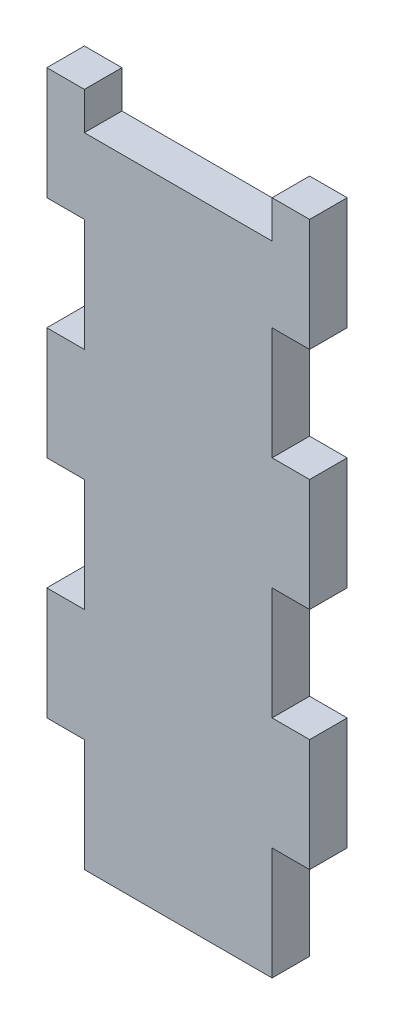
ISO-10303-21;
HEADER;
FILE_DESCRIPTION(('STEP AP214'),'2;1');
FILE_NAME('part.step','',(''),(''),'','','');
FILE_SCHEMA(('AUTOMOTIVE_DESIGN { 1 0 10303 214 1 1 1 1 }'));
ENDSEC;
DATA;
#1=APPLICATION_CONTEXT('core data for automotive mechanical design processes');
#2=APPLICATION_PROTOCOL_DEFINITION('international standard','automotive_design',2000,#1);
#3=PRODUCT_CONTEXT('',#1,'mechanical');
#4=PRODUCT('Part','Part','',(#3));
#5=PRODUCT_RELATED_PRODUCT_CATEGORY('part','',(#4));
#6=PRODUCT_DEFINITION_FORMATION('','',#4);
#7=PRODUCT_DEFINITION_CONTEXT('part definition',#1,'design');
#8=PRODUCT_DEFINITION('design','',#6,#7);
#9=PRODUCT_DEFINITION_SHAPE('','',#8);
#10=(LENGTH_UNIT() NAMED_UNIT(*) SI_UNIT(.MILLI.,.METRE.));
#11=(NAMED_UNIT(*) PLANE_ANGLE_UNIT() SI_UNIT($,.RADIAN.));
#12=(NAMED_UNIT(*) SI_UNIT($,.STERADIAN.) SOLID_ANGLE_UNIT());
#13=UNCERTAINTY_MEASURE_WITH_UNIT(LENGTH_MEASURE(1.E-05),#10,'distance_accuracy_value','');
#14=(GEOMETRIC_REPRESENTATION_CONTEXT(3) GLOBAL_UNCERTAINTY_ASSIGNED_CONTEXT((#13)) GLOBAL_UNIT_ASSIGNED_CONTEXT((#10,
#11,#12)) REPRESENTATION_CONTEXT('',''));
#15=CARTESIAN_POINT('',(0.,0.,0.));
#16=DIRECTION('',(0.,0.,1.));
#17=DIRECTION('',(1.,0.,0.));
#18=AXIS2_PLACEMENT_3D('',#15,#16,#17);
#19=CARTESIAN_POINT('',(18.8215449358851,79.3244842961484,6.));
#20=DIRECTION('',(0.,1.,0.));
#21=DIRECTION('',(0.,0.,1.));
#22=AXIS2_PLACEMENT_3D('',#19,#20,#21);
#23=PLANE('',#22);
#24=DIRECTION('',(1.,0.,0.));
#25=VECTOR('',#24,1.);
#26=CARTESIAN_POINT('',(18.8215449358851,79.3244842961484,0.));
#27=LINE('',#26,#25);
#28=CARTESIAN_POINT('',(18.8215449358851,79.3244842961484,0.));
#29=VERTEX_POINT('',#28);
#30=CARTESIAN_POINT('',(24.8215449358851,79.3244842961484,0.));
#31=VERTEX_POINT('',#30);
#32=EDGE_CURVE('E262',#29,#31,#27,.T.);
#33=ORIENTED_EDGE('',*,*,#32,.F.);
#34=DIRECTION('',(0.,0.,-1.));
#35=VECTOR('',#34,1.);
#36=CARTESIAN_POINT('',(18.8215449358851,79.3244842961484,6.));
#37=LINE('',#36,#35);
#38=CARTESIAN_POINT('',(18.8215449358851,79.3244842961484,6.));
#39=VERTEX_POINT('',#38);
#40=EDGE_CURVE('E11',#39,#29,#37,.T.);
#41=ORIENTED_EDGE('',*,*,#40,.F.);
#42=DIRECTION('',(1.,0.,0.));
#43=VECTOR('',#42,1.);
#44=CARTESIAN_POINT('',(18.8215449358851,79.3244842961484,6.));
#45=LINE('',#44,#43);
#46=CARTESIAN_POINT('',(24.8215449358851,79.3244842961484,6.));
#47=VERTEX_POINT('',#46);
#48=EDGE_CURVE('E364',#39,#47,#45,.T.);
#49=ORIENTED_EDGE('',*,*,#48,.T.);
#50=DIRECTION('',(0.,0.,-1.));
#51=VECTOR('',#50,1.);
#52=CARTESIAN_POINT('',(24.8215449358851,79.3244842961484,6.));
#53=LINE('',#52,#51);
#54=EDGE_CURVE('E42',#47,#31,#53,.T.);
#55=ORIENTED_EDGE('',*,*,#54,.T.);
#56=EDGE_LOOP('',(#33,#41,#49,#55));
#57=FACE_BOUND('',#56,.T.);
#58=ADVANCED_FACE('F39',(#57),#23,.T.);
#59=CARTESIAN_POINT('',(18.8215449358851,79.3244842961484,6.));
#60=DIRECTION('',(1.,0.,0.));
#61=DIRECTION('',(0.,0.,-1.));
#62=AXIS2_PLACEMENT_3D('',#59,#60,#61);
#63=PLANE('',#62);
#64=DIRECTION('',(0.,-1.,0.));
#65=VECTOR('',#64,1.);
#66=CARTESIAN_POINT('',(18.8215449358851,79.3244842961484,0.));
#67=LINE('',#66,#65);
#68=CARTESIAN_POINT('',(18.8215449358851,61.3244842961484,0.));
#69=VERTEX_POINT('',#68);
#70=EDGE_CURVE('E145',#29,#69,#67,.T.);
#71=ORIENTED_EDGE('',*,*,#70,.T.);
#72=DIRECTION('',(0.,0.,-1.));
#73=VECTOR('',#72,1.);
#74=CARTESIAN_POINT('',(18.8215449358851,61.3244842961484,6.));
#75=LINE('',#74,#73);
#76=CARTESIAN_POINT('',(18.8215449358851,61.3244842961484,6.));
#77=VERTEX_POINT('',#76);
#78=EDGE_CURVE('E49',#77,#69,#75,.T.);
#79=ORIENTED_EDGE('',*,*,#78,.F.);
#80=DIRECTION('',(0.,-1.,0.));
#81=VECTOR('',#80,1.);
#82=CARTESIAN_POINT('',(18.8215449358851,79.3244842961484,6.));
#83=LINE('',#82,#81);
#84=EDGE_CURVE('E235',#39,#77,#83,.T.);
#85=ORIENTED_EDGE('',*,*,#84,.F.);
#86=ORIENTED_EDGE('',*,*,#40,.T.);
#87=EDGE_LOOP('',(#71,#79,#85,#86));
#88=FACE_BOUND('',#87,.T.);
#89=ADVANCED_FACE('F637',(#88),#63,.F.);
#90=CARTESIAN_POINT('',(18.8215449358851,61.3244842961484,6.));
#91=DIRECTION('',(0.,1.,0.));
#92=DIRECTION('',(0.,0.,1.));
#93=AXIS2_PLACEMENT_3D('',#90,#91,#92);
#94=PLANE('',#93);
#95=DIRECTION('',(1.,0.,0.));
#96=VECTOR('',#95,1.);
#97=CARTESIAN_POINT('',(18.8215449358851,61.3244842961484,0.));
#98=LINE('',#97,#96);
#99=CARTESIAN_POINT('',(24.8215449358851,61.3244842961484,0.));
#100=VERTEX_POINT('',#99);
#101=EDGE_CURVE('E243',#69,#100,#98,.T.);
#102=ORIENTED_EDGE('',*,*,#101,.T.);
#103=DIRECTION('',(0.,0.,-1.));
#104=VECTOR('',#103,1.);
#105=CARTESIAN_POINT('',(24.8215449358851,61.3244842961484,6.));
#106=LINE('',#105,#104);
#107=CARTESIAN_POINT('',(24.8215449358851,61.3244842961484,6.));
#108=VERTEX_POINT('',#107);
#109=EDGE_CURVE('E240',#108,#100,#106,.T.);
#110=ORIENTED_EDGE('',*,*,#109,.F.);
#111=DIRECTION('',(1.,0.,0.));
#112=VECTOR('',#111,1.);
#113=CARTESIAN_POINT('',(18.8215449358851,61.3244842961484,6.));
#114=LINE('',#113,#112);
#115=EDGE_CURVE('E229',#77,#108,#114,.T.);
#116=ORIENTED_EDGE('',*,*,#115,.F.);
#117=ORIENTED_EDGE('',*,*,#78,.T.);
#118=EDGE_LOOP('',(#102,#110,#116,#117));
#119=FACE_BOUND('',#118,.T.);
#120=ADVANCED_FACE('F241',(#119),#94,.F.);
#121=CARTESIAN_POINT('',(24.8215449358851,61.3244842961484,6.));
#122=DIRECTION('',(1.,0.,0.));
#123=DIRECTION('',(0.,0.,-1.));
#124=AXIS2_PLACEMENT_3D('',#121,#122,#123);
#125=PLANE('',#124);
#126=DIRECTION('',(0.,-1.,0.));
#127=VECTOR('',#126,1.);
#128=CARTESIAN_POINT('',(24.8215449358851,61.3244842961484,0.));
#129=LINE('',#128,#127);
#130=CARTESIAN_POINT('',(24.8215449358851,43.3244842961484,0.));
#131=VERTEX_POINT('',#130);
#132=EDGE_CURVE('E358',#100,#131,#129,.T.);
#133=ORIENTED_EDGE('',*,*,#132,.T.);
#134=DIRECTION('',(0.,0.,-1.));
#135=VECTOR('',#134,1.);
#136=CARTESIAN_POINT('',(24.8215449358851,43.3244842961484,6.));
#137=LINE('',#136,#135);
#138=CARTESIAN_POINT('',(24.8215449358851,43.3244842961484,6.));
#139=VERTEX_POINT('',#138);
#140=EDGE_CURVE('E247',#139,#131,#137,.T.);
#141=ORIENTED_EDGE('',*,*,#140,.F.);
#142=DIRECTION('',(0.,-1.,0.));
#143=VECTOR('',#142,1.);
#144=CARTESIAN_POINT('',(24.8215449358851,61.3244842961484,6.));
#145=LINE('',#144,#143);
#146=EDGE_CURVE('E233',#108,#139,#145,.T.);
#147=ORIENTED_EDGE('',*,*,#146,.F.);
#148=ORIENTED_EDGE('',*,*,#109,.T.);
#149=EDGE_LOOP('',(#133,#141,#147,#148));
#150=FACE_BOUND('',#149,.T.);
#151=ADVANCED_FACE('F249',(#150),#125,.F.);
#152=CARTESIAN_POINT('',(24.8215449358851,43.3244842961484,6.));
#153=DIRECTION('',(0.,-1.,0.));
#154=DIRECTION('',(0.,0.,-1.));
#155=AXIS2_PLACEMENT_3D('',#152,#153,#154);
#156=PLANE('',#155);
#157=DIRECTION('',(-1.,0.,0.));
#158=VECTOR('',#157,1.);
#159=CARTESIAN_POINT('',(24.8215449358851,43.3244842961484,0.));
#160=LINE('',#159,#158);
#161=CARTESIAN_POINT('',(18.8215449358851,43.3244842961484,0.));
#162=VERTEX_POINT('',#161);
#163=EDGE_CURVE('E355',#131,#162,#160,.T.);
#164=ORIENTED_EDGE('',*,*,#163,.T.);
#165=DIRECTION('',(0.,0.,-1.));
#166=VECTOR('',#165,1.);
#167=CARTESIAN_POINT('',(18.8215449358851,43.3244842961484,6.));
#168=LINE('',#167,#166);
#169=CARTESIAN_POINT('',(18.8215449358851,43.3244842961484,6.));
#170=VERTEX_POINT('',#169);
#171=EDGE_CURVE('E370',#170,#162,#168,.T.);
#172=ORIENTED_EDGE('',*,*,#171,.F.);
#173=DIRECTION('',(-1.,0.,0.));
#174=VECTOR('',#173,1.);
#175=CARTESIAN_POINT('',(24.8215449358851,43.3244842961484,6.));
#176=LINE('',#175,#174);
#177=EDGE_CURVE('E253',#139,#170,#176,.T.);
#178=ORIENTED_EDGE('',*,*,#177,.F.);
#179=ORIENTED_EDGE('',*,*,#140,.T.);
#180=EDGE_LOOP('',(#164,#172,#178,#179));
#181=FACE_BOUND('',#180,.T.);
#182=ADVANCED_FACE('F453',(#181),#156,.F.);
#183=CARTESIAN_POINT('',(18.8215449358851,43.3244842961484,6.));
#184=DIRECTION('',(1.,0.,0.));
#185=DIRECTION('',(0.,0.,-1.));
#186=AXIS2_PLACEMENT_3D('',#183,#184,#185);
#187=PLANE('',#186);
#188=DIRECTION('',(0.,-1.,0.));
#189=VECTOR('',#188,1.);
#190=CARTESIAN_POINT('',(18.8215449358851,43.3244842961484,0.));
#191=LINE('',#190,#189);
#192=CARTESIAN_POINT('',(18.8215449358851,25.3244842961484,0.));
#193=VERTEX_POINT('',#192);
#194=EDGE_CURVE('E352',#162,#193,#191,.T.);
#195=ORIENTED_EDGE('',*,*,#194,.T.);
#196=DIRECTION('',(0.,0.,-1.));
#197=VECTOR('',#196,1.);
#198=CARTESIAN_POINT('',(18.8215449358851,25.3244842961484,6.));
#199=LINE('',#198,#197);
#200=CARTESIAN_POINT('',(18.8215449358851,25.3244842961484,6.));
#201=VERTEX_POINT('',#200);
#202=EDGE_CURVE('E374',#201,#193,#199,.T.);
#203=ORIENTED_EDGE('',*,*,#202,.F.);
#204=DIRECTION('',(0.,-1.,0.));
#205=VECTOR('',#204,1.);
#206=CARTESIAN_POINT('',(18.8215449358851,43.3244842961484,6.));
#207=LINE('',#206,#205);
#208=EDGE_CURVE('E256',#170,#201,#207,.T.);
#209=ORIENTED_EDGE('',*,*,#208,.F.);
#210=ORIENTED_EDGE('',*,*,#171,.T.);
#211=EDGE_LOOP('',(#195,#203,#209,#210));
#212=FACE_BOUND('',#211,.T.);
#213=ADVANCED_FACE('F463',(#212),#187,.F.);
#214=CARTESIAN_POINT('',(18.8215449358851,25.3244842961484,6.));
#215=DIRECTION('',(0.,1.,0.));
#216=DIRECTION('',(0.,0.,1.));
#217=AXIS2_PLACEMENT_3D('',#214,#215,#216);
#218=PLANE('',#217);
#219=DIRECTION('',(1.,0.,0.));
#220=VECTOR('',#219,1.);
#221=CARTESIAN_POINT('',(18.8215449358851,25.3244842961484,0.));
#222=LINE('',#221,#220);
#223=CARTESIAN_POINT('',(24.8215449358851,25.3244842961484,0.));
#224=VERTEX_POINT('',#223);
#225=EDGE_CURVE('E348',#193,#224,#222,.T.);
#226=ORIENTED_EDGE('',*,*,#225,.T.);
#227=DIRECTION('',(0.,0.,-1.));
#228=VECTOR('',#227,1.);
#229=CARTESIAN_POINT('',(24.8215449358851,25.3244842961484,6.));
#230=LINE('',#229,#228);
#231=CARTESIAN_POINT('',(24.8215449358851,25.3244842961484,6.));
#232=VERTEX_POINT('',#231);
#233=EDGE_CURVE('E378',#232,#224,#230,.T.);
#234=ORIENTED_EDGE('',*,*,#233,.F.);
#235=DIRECTION('',(1.,0.,0.));
#236=VECTOR('',#235,1.);
#237=CARTESIAN_POINT('',(18.8215449358851,25.3244842961484,6.));
#238=LINE('',#237,#236);
#239=EDGE_CURVE('E459',#201,#232,#238,.T.);
#240=ORIENTED_EDGE('',*,*,#239,.F.);
#241=ORIENTED_EDGE('',*,*,#202,.T.);
#242=EDGE_LOOP('',(#226,#234,#240,#241));
#243=FACE_BOUND('',#242,.T.);
#244=ADVANCED_FACE('F466',(#243),#218,.F.);
#245=CARTESIAN_POINT('',(24.8215449358842,15.3244842961493,6.));
#246=DIRECTION('',(-1.,0.,0.));
#247=DIRECTION('',(0.,-1.,0.));
#248=AXIS2_PLACEMENT_3D('',#245,#246,#247);
#249=PLANE('',#248);
#250=DIRECTION('',(0.,1.,0.));
#251=VECTOR('',#250,1.);
#252=CARTESIAN_POINT('',(24.8215449358842,15.3244842961493,0.));
#253=LINE('',#252,#251);
#254=CARTESIAN_POINT('',(24.8215449358837,7.32448429615111,0.));
#255=VERTEX_POINT('',#254);
#256=EDGE_CURVE('E344',#255,#224,#253,.T.);
#257=ORIENTED_EDGE('',*,*,#256,.F.);
#258=DIRECTION('',(0.,0.,-1.));
#259=VECTOR('',#258,1.);
#260=CARTESIAN_POINT('',(24.8215449358837,7.32448429615111,6.));
#261=LINE('',#260,#259);
#262=CARTESIAN_POINT('',(24.8215449358837,7.32448429615111,6.));
#263=VERTEX_POINT('',#262);
#264=EDGE_CURVE('E381',#263,#255,#261,.T.);
#265=ORIENTED_EDGE('',*,*,#264,.F.);
#266=DIRECTION('',(0.,-1.,0.));
#267=VECTOR('',#266,1.);
#268=CARTESIAN_POINT('',(24.8215449358842,15.3244842961493,6.));
#269=LINE('',#268,#267);
#270=EDGE_CURVE('E468',#232,#263,#269,.T.);
#271=ORIENTED_EDGE('',*,*,#270,.F.);
#272=ORIENTED_EDGE('',*,*,#233,.T.);
#273=EDGE_LOOP('',(#257,#265,#271,#272));
#274=FACE_BOUND('',#273,.T.);
#275=ADVANCED_FACE('F626',(#274),#249,.T.);
#276=CARTESIAN_POINT('',(54.8215449358851,7.32448429614838,6.));
#277=DIRECTION('',(0.,-1.,0.));
#278=DIRECTION('',(1.,0.,0.));
#279=AXIS2_PLACEMENT_3D('',#276,#277,#278);
#280=PLANE('',#279);
#281=DIRECTION('',(-1.,0.,0.));
#282=VECTOR('',#281,1.);
#283=CARTESIAN_POINT('',(54.8215449358851,7.32448429614838,0.));
#284=LINE('',#283,#282);
#285=CARTESIAN_POINT('',(54.8215449358851,7.32448429614838,0.));
#286=VERTEX_POINT('',#285);
#287=EDGE_CURVE('E340',#286,#255,#284,.T.);
#288=ORIENTED_EDGE('',*,*,#287,.F.);
#289=DIRECTION('',(0.,0.,-1.));
#290=VECTOR('',#289,1.);
#291=CARTESIAN_POINT('',(54.8215449358851,7.32448429614838,6.));
#292=LINE('',#291,#290);
#293=CARTESIAN_POINT('',(54.8215449358851,7.32448429614838,6.));
#294=VERTEX_POINT('',#293);
#295=EDGE_CURVE('E385',#294,#286,#292,.T.);
#296=ORIENTED_EDGE('',*,*,#295,.F.);
#297=DIRECTION('',(-1.,0.,0.));
#298=VECTOR('',#297,1.);
#299=CARTESIAN_POINT('',(54.8215449358851,7.32448429614838,6.));
#300=LINE('',#299,#298);
#301=EDGE_CURVE('E471',#294,#263,#300,.T.);
#302=ORIENTED_EDGE('',*,*,#301,.T.);
#303=ORIENTED_EDGE('',*,*,#264,.T.);
#304=EDGE_LOOP('',(#288,#296,#302,#303));
#305=FACE_BOUND('',#304,.T.);
#306=ADVANCED_FACE('F623',(#305),#280,.T.);
#307=CARTESIAN_POINT('',(54.8215449358851,25.3244842961484,6.));
#308=DIRECTION('',(1.,0.,0.));
#309=DIRECTION('',(0.,0.,-1.));
#310=AXIS2_PLACEMENT_3D('',#307,#308,#309);
#311=PLANE('',#310);
#312=DIRECTION('',(0.,-1.,0.));
#313=VECTOR('',#312,1.);
#314=CARTESIAN_POINT('',(54.8215449358851,25.3244842961484,0.));
#315=LINE('',#314,#313);
#316=CARTESIAN_POINT('',(54.8215449358851,25.3244842961484,0.));
#317=VERTEX_POINT('',#316);
#318=EDGE_CURVE('E336',#317,#286,#315,.T.);
#319=ORIENTED_EDGE('',*,*,#318,.F.);
#320=DIRECTION('',(0.,0.,-1.));
#321=VECTOR('',#320,1.);
#322=CARTESIAN_POINT('',(54.8215449358851,25.3244842961484,6.));
#323=LINE('',#322,#321);
#324=CARTESIAN_POINT('',(54.8215449358851,25.3244842961484,6.));
#325=VERTEX_POINT('',#324);
#326=EDGE_CURVE('E388',#325,#317,#323,.T.);
#327=ORIENTED_EDGE('',*,*,#326,.F.);
#328=DIRECTION('',(0.,-1.,0.));
#329=VECTOR('',#328,1.);
#330=CARTESIAN_POINT('',(54.8215449358851,25.3244842961484,6.));
#331=LINE('',#330,#329);
#332=EDGE_CURVE('E477',#325,#294,#331,.T.);
#333=ORIENTED_EDGE('',*,*,#332,.T.);
#334=ORIENTED_EDGE('',*,*,#295,.T.);
#335=EDGE_LOOP('',(#319,#327,#333,#334));
#336=FACE_BOUND('',#335,.T.);
#337=ADVANCED_FACE('F619',(#336),#311,.T.);
#338=CARTESIAN_POINT('',(60.8215449358851,25.3244842961484,6.));
#339=DIRECTION('',(0.,-1.,0.));
#340=DIRECTION('',(0.,0.,-1.));
#341=AXIS2_PLACEMENT_3D('',#338,#339,#340);
#342=PLANE('',#341);
#343=DIRECTION('',(-1.,0.,0.));
#344=VECTOR('',#343,1.);
#345=CARTESIAN_POINT('',(60.8215449358851,25.3244842961484,0.));
#346=LINE('',#345,#344);
#347=CARTESIAN_POINT('',(60.8215449358851,25.3244842961484,0.));
#348=VERTEX_POINT('',#347);
#349=EDGE_CURVE('E332',#348,#317,#346,.T.);
#350=ORIENTED_EDGE('',*,*,#349,.F.);
#351=DIRECTION('',(0.,0.,-1.));
#352=VECTOR('',#351,1.);
#353=CARTESIAN_POINT('',(60.8215449358851,25.3244842961484,6.));
#354=LINE('',#353,#352);
#355=CARTESIAN_POINT('',(60.8215449358851,25.3244842961484,6.));
#356=VERTEX_POINT('',#355);
#357=EDGE_CURVE('E391',#356,#348,#354,.T.);
#358=ORIENTED_EDGE('',*,*,#357,.F.);
#359=DIRECTION('',(-1.,0.,0.));
#360=VECTOR('',#359,1.);
#361=CARTESIAN_POINT('',(60.8215449358851,25.3244842961484,6.));
#362=LINE('',#361,#360);
#363=EDGE_CURVE('E481',#356,#325,#362,.T.);
#364=ORIENTED_EDGE('',*,*,#363,.T.);
#365=ORIENTED_EDGE('',*,*,#326,.T.);
#366=EDGE_LOOP('',(#350,#358,#364,#365));
#367=FACE_BOUND('',#366,.T.);
#368=ADVANCED_FACE('F615',(#367),#342,.T.);
#369=CARTESIAN_POINT('',(60.8215449358851,43.3244842961484,6.));
#370=DIRECTION('',(1.,0.,0.));
#371=DIRECTION('',(0.,0.,-1.));
#372=AXIS2_PLACEMENT_3D('',#369,#370,#371);
#373=PLANE('',#372);
#374=DIRECTION('',(0.,-1.,0.));
#375=VECTOR('',#374,1.);
#376=CARTESIAN_POINT('',(60.8215449358851,43.3244842961484,0.));
#377=LINE('',#376,#375);
#378=CARTESIAN_POINT('',(60.8215449358851,43.3244842961484,0.));
#379=VERTEX_POINT('',#378);
#380=EDGE_CURVE('E328',#379,#348,#377,.T.);
#381=ORIENTED_EDGE('',*,*,#380,.F.);
#382=DIRECTION('',(0.,0.,-1.));
#383=VECTOR('',#382,1.);
#384=CARTESIAN_POINT('',(60.8215449358851,43.3244842961484,6.));
#385=LINE('',#384,#383);
#386=CARTESIAN_POINT('',(60.8215449358851,43.3244842961484,6.));
#387=VERTEX_POINT('',#386);
#388=EDGE_CURVE('E394',#387,#379,#385,.T.);
#389=ORIENTED_EDGE('',*,*,#388,.F.);
#390=DIRECTION('',(0.,-1.,0.));
#391=VECTOR('',#390,1.);
#392=CARTESIAN_POINT('',(60.8215449358851,43.3244842961484,6.));
#393=LINE('',#392,#391);
#394=EDGE_CURVE('E485',#387,#356,#393,.T.);
#395=ORIENTED_EDGE('',*,*,#394,.T.);
#396=ORIENTED_EDGE('',*,*,#357,.T.);
#397=EDGE_LOOP('',(#381,#389,#395,#396));
#398=FACE_BOUND('',#397,.T.);
#399=ADVANCED_FACE('F611',(#398),#373,.T.);
#400=CARTESIAN_POINT('',(54.8215449358851,43.3244842961484,6.));
#401=DIRECTION('',(0.,1.,0.));
#402=DIRECTION('',(0.,0.,1.));
#403=AXIS2_PLACEMENT_3D('',#400,#401,#402);
#404=PLANE('',#403);
#405=DIRECTION('',(1.,0.,0.));
#406=VECTOR('',#405,1.);
#407=CARTESIAN_POINT('',(54.8215449358851,43.3244842961484,0.));
#408=LINE('',#407,#406);
#409=CARTESIAN_POINT('',(54.8215449358851,43.3244842961484,0.));
#410=VERTEX_POINT('',#409);
#411=EDGE_CURVE('E324',#410,#379,#408,.T.);
#412=ORIENTED_EDGE('',*,*,#411,.F.);
#413=DIRECTION('',(0.,0.,-1.));
#414=VECTOR('',#413,1.);
#415=CARTESIAN_POINT('',(54.8215449358851,43.3244842961484,6.));
#416=LINE('',#415,#414);
#417=CARTESIAN_POINT('',(54.8215449358851,43.3244842961484,6.));
#418=VERTEX_POINT('',#417);
#419=EDGE_CURVE('E397',#418,#410,#416,.T.);
#420=ORIENTED_EDGE('',*,*,#419,.F.);
#421=DIRECTION('',(1.,0.,0.));
#422=VECTOR('',#421,1.);
#423=CARTESIAN_POINT('',(54.8215449358851,43.3244842961484,6.));
#424=LINE('',#423,#422);
#425=EDGE_CURVE('E489',#418,#387,#424,.T.);
#426=ORIENTED_EDGE('',*,*,#425,.T.);
#427=ORIENTED_EDGE('',*,*,#388,.T.);
#428=EDGE_LOOP('',(#412,#420,#426,#427));
#429=FACE_BOUND('',#428,.T.);
#430=ADVANCED_FACE('F607',(#429),#404,.T.);
#431=CARTESIAN_POINT('',(54.8215449358851,61.3244842961484,6.));
#432=DIRECTION('',(1.,0.,0.));
#433=DIRECTION('',(0.,0.,-1.));
#434=AXIS2_PLACEMENT_3D('',#431,#432,#433);
#435=PLANE('',#434);
#436=DIRECTION('',(0.,-1.,0.));
#437=VECTOR('',#436,1.);
#438=CARTESIAN_POINT('',(54.8215449358851,61.3244842961484,0.));
#439=LINE('',#438,#437);
#440=CARTESIAN_POINT('',(54.8215449358851,61.3244842961484,0.));
#441=VERTEX_POINT('',#440);
#442=EDGE_CURVE('E320',#441,#410,#439,.T.);
#443=ORIENTED_EDGE('',*,*,#442,.F.);
#444=DIRECTION('',(0.,0.,-1.));
#445=VECTOR('',#444,1.);
#446=CARTESIAN_POINT('',(54.8215449358851,61.3244842961484,6.));
#447=LINE('',#446,#445);
#448=CARTESIAN_POINT('',(54.8215449358851,61.3244842961484,6.));
#449=VERTEX_POINT('',#448);
#450=EDGE_CURVE('E400',#449,#441,#447,.T.);
#451=ORIENTED_EDGE('',*,*,#450,.F.);
#452=DIRECTION('',(0.,-1.,0.));
#453=VECTOR('',#452,1.);
#454=CARTESIAN_POINT('',(54.8215449358851,61.3244842961484,6.));
#455=LINE('',#454,#453);
#456=EDGE_CURVE('E493',#449,#418,#455,.T.);
#457=ORIENTED_EDGE('',*,*,#456,.T.);
#458=ORIENTED_EDGE('',*,*,#419,.T.);
#459=EDGE_LOOP('',(#443,#451,#457,#458));
#460=FACE_BOUND('',#459,.T.);
#461=ADVANCED_FACE('F603',(#460),#435,.T.);
#462=CARTESIAN_POINT('',(60.8215449358851,61.3244842961484,6.));
#463=DIRECTION('',(0.,-1.,0.));
#464=DIRECTION('',(0.,0.,-1.));
#465=AXIS2_PLACEMENT_3D('',#462,#463,#464);
#466=PLANE('',#465);
#467=DIRECTION('',(-1.,0.,0.));
#468=VECTOR('',#467,1.);
#469=CARTESIAN_POINT('',(60.8215449358851,61.3244842961484,0.));
#470=LINE('',#469,#468);
#471=CARTESIAN_POINT('',(60.8215449358851,61.3244842961484,0.));
#472=VERTEX_POINT('',#471);
#473=EDGE_CURVE('E316',#472,#441,#470,.T.);
#474=ORIENTED_EDGE('',*,*,#473,.F.);
#475=DIRECTION('',(0.,0.,-1.));
#476=VECTOR('',#475,1.);
#477=CARTESIAN_POINT('',(60.8215449358851,61.3244842961484,6.));
#478=LINE('',#477,#476);
#479=CARTESIAN_POINT('',(60.8215449358851,61.3244842961484,6.));
#480=VERTEX_POINT('',#479);
#481=EDGE_CURVE('E403',#480,#472,#478,.T.);
#482=ORIENTED_EDGE('',*,*,#481,.F.);
#483=DIRECTION('',(-1.,0.,0.));
#484=VECTOR('',#483,1.);
#485=CARTESIAN_POINT('',(60.8215449358851,61.3244842961484,6.));
#486=LINE('',#485,#484);
#487=EDGE_CURVE('E497',#480,#449,#486,.T.);
#488=ORIENTED_EDGE('',*,*,#487,.T.);
#489=ORIENTED_EDGE('',*,*,#450,.T.);
#490=EDGE_LOOP('',(#474,#482,#488,#489));
#491=FACE_BOUND('',#490,.T.);
#492=ADVANCED_FACE('F599',(#491),#466,.T.);
#493=CARTESIAN_POINT('',(60.8215449358851,79.3244842961484,6.));
#494=DIRECTION('',(1.,0.,0.));
#495=DIRECTION('',(0.,0.,-1.));
#496=AXIS2_PLACEMENT_3D('',#493,#494,#495);
#497=PLANE('',#496);
#498=DIRECTION('',(0.,-1.,0.));
#499=VECTOR('',#498,1.);
#500=CARTESIAN_POINT('',(60.8215449358851,79.3244842961484,0.));
#501=LINE('',#500,#499);
#502=CARTESIAN_POINT('',(60.8215449358851,79.3244842961484,0.));
#503=VERTEX_POINT('',#502);
#504=EDGE_CURVE('E312',#503,#472,#501,.T.);
#505=ORIENTED_EDGE('',*,*,#504,.F.);
#506=DIRECTION('',(0.,0.,-1.));
#507=VECTOR('',#506,1.);
#508=CARTESIAN_POINT('',(60.8215449358851,79.3244842961484,6.));
#509=LINE('',#508,#507);
#510=CARTESIAN_POINT('',(60.8215449358851,79.3244842961484,6.));
#511=VERTEX_POINT('',#510);
#512=EDGE_CURVE('E406',#511,#503,#509,.T.);
#513=ORIENTED_EDGE('',*,*,#512,.F.);
#514=DIRECTION('',(0.,-1.,0.));
#515=VECTOR('',#514,1.);
#516=CARTESIAN_POINT('',(60.8215449358851,79.3244842961484,6.));
#517=LINE('',#516,#515);
#518=EDGE_CURVE('E501',#511,#480,#517,.T.);
#519=ORIENTED_EDGE('',*,*,#518,.T.);
#520=ORIENTED_EDGE('',*,*,#481,.T.);
#521=EDGE_LOOP('',(#505,#513,#519,#520));
#522=FACE_BOUND('',#521,.T.);
#523=ADVANCED_FACE('F593',(#522),#497,.T.);
#524=CARTESIAN_POINT('',(60.8215449358851,79.3244842961484,6.));
#525=DIRECTION('',(0.,-1.,0.));
#526=DIRECTION('',(0.,0.,-1.));
#527=AXIS2_PLACEMENT_3D('',#524,#525,#526);
#528=PLANE('',#527);
#529=DIRECTION('',(-1.,0.,0.));
#530=VECTOR('',#529,1.);
#531=CARTESIAN_POINT('',(60.8215449358851,79.3244842961484,0.));
#532=LINE('',#531,#530);
#533=CARTESIAN_POINT('',(54.8215449358851,79.3244842961484,0.));
#534=VERTEX_POINT('',#533);
#535=EDGE_CURVE('E308',#503,#534,#532,.T.);
#536=ORIENTED_EDGE('',*,*,#535,.T.);
#537=DIRECTION('',(0.,0.,-1.));
#538=VECTOR('',#537,1.);
#539=CARTESIAN_POINT('',(54.8215449358851,79.3244842961484,6.));
#540=LINE('',#539,#538);
#541=CARTESIAN_POINT('',(54.8215449358851,79.3244842961484,6.));
#542=VERTEX_POINT('',#541);
#543=EDGE_CURVE('E409',#542,#534,#540,.T.);
#544=ORIENTED_EDGE('',*,*,#543,.F.);
#545=DIRECTION('',(-1.,0.,0.));
#546=VECTOR('',#545,1.);
#547=CARTESIAN_POINT('',(60.8215449358851,79.3244842961484,6.));
#548=LINE('',#547,#546);
#549=EDGE_CURVE('E505',#511,#542,#548,.T.);
#550=ORIENTED_EDGE('',*,*,#549,.F.);
#551=ORIENTED_EDGE('',*,*,#512,.T.);
#552=EDGE_LOOP('',(#536,#544,#550,#551));
#553=FACE_BOUND('',#552,.T.);
#554=ADVANCED_FACE('F627',(#553),#528,.F.);
#555=CARTESIAN_POINT('',(54.8215449358851,97.3244842961484,6.));
#556=DIRECTION('',(1.,0.,0.));
#557=DIRECTION('',(0.,0.,-1.));
#558=AXIS2_PLACEMENT_3D('',#555,#556,#557);
#559=PLANE('',#558);
#560=DIRECTION('',(0.,-1.,0.));
#561=VECTOR('',#560,1.);
#562=CARTESIAN_POINT('',(54.8215449358851,97.3244842961484,0.));
#563=LINE('',#562,#561);
#564=CARTESIAN_POINT('',(54.8215449358851,97.3244842961484,0.));
#565=VERTEX_POINT('',#564);
#566=EDGE_CURVE('E304',#565,#534,#563,.T.);
#567=ORIENTED_EDGE('',*,*,#566,.F.);
#568=DIRECTION('',(0.,0.,-1.));
#569=VECTOR('',#568,1.);
#570=CARTESIAN_POINT('',(54.8215449358851,97.3244842961484,6.));
#571=LINE('',#570,#569);
#572=CARTESIAN_POINT('',(54.8215449358851,97.3244842961484,6.));
#573=VERTEX_POINT('',#572);
#574=EDGE_CURVE('E412',#573,#565,#571,.T.);
#575=ORIENTED_EDGE('',*,*,#574,.F.);
#576=DIRECTION('',(0.,-1.,0.));
#577=VECTOR('',#576,1.);
#578=CARTESIAN_POINT('',(54.8215449358851,97.3244842961484,6.));
#579=LINE('',#578,#577);
#580=EDGE_CURVE('E508',#573,#542,#579,.T.);
#581=ORIENTED_EDGE('',*,*,#580,.T.);
#582=ORIENTED_EDGE('',*,*,#543,.T.);
#583=EDGE_LOOP('',(#567,#575,#581,#582));
#584=FACE_BOUND('',#583,.T.);
#585=ADVANCED_FACE('F587',(#584),#559,.T.);
#586=CARTESIAN_POINT('',(60.8215449358851,97.3244842961484,6.));
#587=DIRECTION('',(0.,-1.,0.));
#588=DIRECTION('',(0.,0.,-1.));
#589=AXIS2_PLACEMENT_3D('',#586,#587,#588);
#590=PLANE('',#589);
#591=DIRECTION('',(-1.,0.,0.));
#592=VECTOR('',#591,1.);
#593=CARTESIAN_POINT('',(60.8215449358851,97.3244842961484,0.));
#594=LINE('',#593,#592);
#595=CARTESIAN_POINT('',(60.8215449358851,97.3244842961484,0.));
#596=VERTEX_POINT('',#595);
#597=EDGE_CURVE('E300',#596,#565,#594,.T.);
#598=ORIENTED_EDGE('',*,*,#597,.F.);
#599=DIRECTION('',(0.,0.,-1.));
#600=VECTOR('',#599,1.);
#601=CARTESIAN_POINT('',(60.8215449358851,97.3244842961484,6.));
#602=LINE('',#601,#600);
#603=CARTESIAN_POINT('',(60.8215449358851,97.3244842961484,6.));
#604=VERTEX_POINT('',#603);
#605=EDGE_CURVE('E415',#604,#596,#602,.T.);
#606=ORIENTED_EDGE('',*,*,#605,.F.);
#607=DIRECTION('',(-1.,0.,0.));
#608=VECTOR('',#607,1.);
#609=CARTESIAN_POINT('',(60.8215449358851,97.3244842961484,6.));
#610=LINE('',#609,#608);
#611=EDGE_CURVE('E512',#604,#573,#610,.T.);
#612=ORIENTED_EDGE('',*,*,#611,.T.);
#613=ORIENTED_EDGE('',*,*,#574,.T.);
#614=EDGE_LOOP('',(#598,#606,#612,#613));
#615=FACE_BOUND('',#614,.T.);
#616=ADVANCED_FACE('F583',(#615),#590,.T.);
#617=CARTESIAN_POINT('',(60.8215449358851,115.324484296148,6.));
#618=DIRECTION('',(1.,0.,0.));
#619=DIRECTION('',(0.,0.,-1.));
#620=AXIS2_PLACEMENT_3D('',#617,#618,#619);
#621=PLANE('',#620);
#622=DIRECTION('',(0.,-1.,0.));
#623=VECTOR('',#622,1.);
#624=CARTESIAN_POINT('',(60.8215449358851,115.324484296148,0.));
#625=LINE('',#624,#623);
#626=CARTESIAN_POINT('',(60.8215449358851,115.324484296148,0.));
#627=VERTEX_POINT('',#626);
#628=EDGE_CURVE('E296',#627,#596,#625,.T.);
#629=ORIENTED_EDGE('',*,*,#628,.F.);
#630=DIRECTION('',(0.,0.,-1.));
#631=VECTOR('',#630,1.);
#632=CARTESIAN_POINT('',(60.8215449358851,115.324484296148,6.));
#633=LINE('',#632,#631);
#634=CARTESIAN_POINT('',(60.8215449358851,115.324484296148,6.));
#635=VERTEX_POINT('',#634);
#636=EDGE_CURVE('E418',#635,#627,#633,.T.);
#637=ORIENTED_EDGE('',*,*,#636,.F.);
#638=DIRECTION('',(0.,-1.,0.));
#639=VECTOR('',#638,1.);
#640=CARTESIAN_POINT('',(60.8215449358851,115.324484296148,6.));
#641=LINE('',#640,#639);
#642=EDGE_CURVE('E516',#635,#604,#641,.T.);
#643=ORIENTED_EDGE('',*,*,#642,.T.);
#644=ORIENTED_EDGE('',*,*,#605,.T.);
#645=EDGE_LOOP('',(#629,#637,#643,#644));
#646=FACE_BOUND('',#645,.T.);
#647=ADVANCED_FACE('F579',(#646),#621,.T.);
#648=CARTESIAN_POINT('',(54.8215449358842,115.324484296148,6.));
#649=DIRECTION('',(0.,1.,0.));
#650=DIRECTION('',(0.,0.,1.));
#651=AXIS2_PLACEMENT_3D('',#648,#649,#650);
#652=PLANE('',#651);
#653=DIRECTION('',(1.,0.,0.));
#654=VECTOR('',#653,1.);
#655=CARTESIAN_POINT('',(54.8215449358842,115.324484296148,0.));
#656=LINE('',#655,#654);
#657=CARTESIAN_POINT('',(54.8215449358842,115.324484296148,0.));
#658=VERTEX_POINT('',#657);
#659=EDGE_CURVE('E292',#658,#627,#656,.T.);
#660=ORIENTED_EDGE('',*,*,#659,.F.);
#661=DIRECTION('',(0.,0.,-1.));
#662=VECTOR('',#661,1.);
#663=CARTESIAN_POINT('',(54.8215449358842,115.324484296148,6.));
#664=LINE('',#663,#662);
#665=CARTESIAN_POINT('',(54.8215449358842,115.324484296148,6.));
#666=VERTEX_POINT('',#665);
#667=EDGE_CURVE('E421',#666,#658,#664,.T.);
#668=ORIENTED_EDGE('',*,*,#667,.F.);
#669=DIRECTION('',(1.,0.,0.));
#670=VECTOR('',#669,1.);
#671=CARTESIAN_POINT('',(54.8215449358842,115.324484296148,6.));
#672=LINE('',#671,#670);
#673=EDGE_CURVE('E520',#666,#635,#672,.T.);
#674=ORIENTED_EDGE('',*,*,#673,.T.);
#675=ORIENTED_EDGE('',*,*,#636,.T.);
#676=EDGE_LOOP('',(#660,#668,#674,#675));
#677=FACE_BOUND('',#676,.T.);
#678=ADVANCED_FACE('F575',(#677),#652,.T.);
#679=CARTESIAN_POINT('',(54.8215449358842,109.324484296149,6.));
#680=DIRECTION('',(-1.,0.,0.));
#681=DIRECTION('',(0.,0.,1.));
#682=AXIS2_PLACEMENT_3D('',#679,#680,#681);
#683=PLANE('',#682);
#684=DIRECTION('',(0.,1.,0.));
#685=VECTOR('',#684,1.);
#686=CARTESIAN_POINT('',(54.8215449358842,109.324484296149,0.));
#687=LINE('',#686,#685);
#688=CARTESIAN_POINT('',(54.8215449358842,109.324484296149,0.));
#689=VERTEX_POINT('',#688);
#690=EDGE_CURVE('E288',#689,#658,#687,.T.);
#691=ORIENTED_EDGE('',*,*,#690,.F.);
#692=DIRECTION('',(0.,0.,-1.));
#693=VECTOR('',#692,1.);
#694=CARTESIAN_POINT('',(54.8215449358842,109.324484296149,6.));
#695=LINE('',#694,#693);
#696=CARTESIAN_POINT('',(54.8215449358842,109.324484296149,6.));
#697=VERTEX_POINT('',#696);
#698=EDGE_CURVE('E424',#697,#689,#695,.T.);
#699=ORIENTED_EDGE('',*,*,#698,.F.);
#700=DIRECTION('',(0.,1.,0.));
#701=VECTOR('',#700,1.);
#702=CARTESIAN_POINT('',(54.8215449358842,109.324484296149,6.));
#703=LINE('',#702,#701);
#704=EDGE_CURVE('E524',#697,#666,#703,.T.);
#705=ORIENTED_EDGE('',*,*,#704,.T.);
#706=ORIENTED_EDGE('',*,*,#667,.T.);
#707=EDGE_LOOP('',(#691,#699,#705,#706));
#708=FACE_BOUND('',#707,.T.);
#709=ADVANCED_FACE('F571',(#708),#683,.T.);
#710=CARTESIAN_POINT('',(24.8215449358842,109.324484296149,6.));
#711=DIRECTION('',(0.,1.,0.));
#712=DIRECTION('',(0.,0.,1.));
#713=AXIS2_PLACEMENT_3D('',#710,#711,#712);
#714=PLANE('',#713);
#715=DIRECTION('',(1.,0.,0.));
#716=VECTOR('',#715,1.);
#717=CARTESIAN_POINT('',(24.8215449358842,109.324484296149,0.));
#718=LINE('',#717,#716);
#719=CARTESIAN_POINT('',(24.8215449358842,109.324484296149,0.));
#720=VERTEX_POINT('',#719);
#721=EDGE_CURVE('E284',#720,#689,#718,.T.);
#722=ORIENTED_EDGE('',*,*,#721,.F.);
#723=DIRECTION('',(0.,0.,-1.));
#724=VECTOR('',#723,1.);
#725=CARTESIAN_POINT('',(24.8215449358842,109.324484296149,6.));
#726=LINE('',#725,#724);
#727=CARTESIAN_POINT('',(24.8215449358842,109.324484296149,6.));
#728=VERTEX_POINT('',#727);
#729=EDGE_CURVE('E427',#728,#720,#726,.T.);
#730=ORIENTED_EDGE('',*,*,#729,.F.);
#731=DIRECTION('',(1.,0.,0.));
#732=VECTOR('',#731,1.);
#733=CARTESIAN_POINT('',(24.8215449358842,109.324484296149,6.));
#734=LINE('',#733,#732);
#735=EDGE_CURVE('E528',#728,#697,#734,.T.);
#736=ORIENTED_EDGE('',*,*,#735,.T.);
#737=ORIENTED_EDGE('',*,*,#698,.T.);
#738=EDGE_LOOP('',(#722,#730,#736,#737));
#739=FACE_BOUND('',#738,.T.);
#740=ADVANCED_FACE('F567',(#739),#714,.T.);
#741=CARTESIAN_POINT('',(24.8215449358842,115.324484296149,6.));
#742=DIRECTION('',(1.,0.,0.));
#743=DIRECTION('',(0.,0.,-1.));
#744=AXIS2_PLACEMENT_3D('',#741,#742,#743);
#745=PLANE('',#744);
#746=DIRECTION('',(0.,-1.,0.));
#747=VECTOR('',#746,1.);
#748=CARTESIAN_POINT('',(24.8215449358842,115.324484296149,0.));
#749=LINE('',#748,#747);
#750=CARTESIAN_POINT('',(24.8215449358842,115.324484296149,0.));
#751=VERTEX_POINT('',#750);
#752=EDGE_CURVE('E280',#751,#720,#749,.T.);
#753=ORIENTED_EDGE('',*,*,#752,.F.);
#754=DIRECTION('',(0.,0.,-1.));
#755=VECTOR('',#754,1.);
#756=CARTESIAN_POINT('',(24.8215449358842,115.324484296149,6.));
#757=LINE('',#756,#755);
#758=CARTESIAN_POINT('',(24.8215449358842,115.324484296149,6.));
#759=VERTEX_POINT('',#758);
#760=EDGE_CURVE('E430',#759,#751,#757,.T.);
#761=ORIENTED_EDGE('',*,*,#760,.F.);
#762=DIRECTION('',(0.,-1.,0.));
#763=VECTOR('',#762,1.);
#764=CARTESIAN_POINT('',(24.8215449358842,115.324484296149,6.));
#765=LINE('',#764,#763);
#766=EDGE_CURVE('E532',#759,#728,#765,.T.);
#767=ORIENTED_EDGE('',*,*,#766,.T.);
#768=ORIENTED_EDGE('',*,*,#729,.T.);
#769=EDGE_LOOP('',(#753,#761,#767,#768));
#770=FACE_BOUND('',#769,.T.);
#771=ADVANCED_FACE('F563',(#770),#745,.T.);
#772=CARTESIAN_POINT('',(18.8215449358851,115.324484296148,6.));
#773=DIRECTION('',(0.,1.,0.));
#774=DIRECTION('',(-1.,0.,0.));
#775=AXIS2_PLACEMENT_3D('',#772,#773,#774);
#776=PLANE('',#775);
#777=DIRECTION('',(1.,0.,0.));
#778=VECTOR('',#777,1.);
#779=CARTESIAN_POINT('',(18.8215449358851,115.324484296148,0.));
#780=LINE('',#779,#778);
#781=CARTESIAN_POINT('',(18.8215449358851,115.324484296148,0.));
#782=VERTEX_POINT('',#781);
#783=EDGE_CURVE('E276',#782,#751,#780,.T.);
#784=ORIENTED_EDGE('',*,*,#783,.F.);
#785=DIRECTION('',(0.,0.,-1.));
#786=VECTOR('',#785,1.);
#787=CARTESIAN_POINT('',(18.8215449358851,115.324484296148,6.));
#788=LINE('',#787,#786);
#789=CARTESIAN_POINT('',(18.8215449358851,115.324484296148,6.));
#790=VERTEX_POINT('',#789);
#791=EDGE_CURVE('E433',#790,#782,#788,.T.);
#792=ORIENTED_EDGE('',*,*,#791,.F.);
#793=DIRECTION('',(1.,0.,0.));
#794=VECTOR('',#793,1.);
#795=CARTESIAN_POINT('',(18.8215449358851,115.324484296148,6.));
#796=LINE('',#795,#794);
#797=EDGE_CURVE('E536',#790,#759,#796,.T.);
#798=ORIENTED_EDGE('',*,*,#797,.T.);
#799=ORIENTED_EDGE('',*,*,#760,.T.);
#800=EDGE_LOOP('',(#784,#792,#798,#799));
#801=FACE_BOUND('',#800,.T.);
#802=ADVANCED_FACE('F559',(#801),#776,.T.);
#803=CARTESIAN_POINT('',(18.8215449358851,115.324484296148,6.));
#804=DIRECTION('',(1.,0.,0.));
#805=DIRECTION('',(0.,0.,-1.));
#806=AXIS2_PLACEMENT_3D('',#803,#804,#805);
#807=PLANE('',#806);
#808=DIRECTION('',(0.,-1.,0.));
#809=VECTOR('',#808,1.);
#810=CARTESIAN_POINT('',(18.8215449358851,115.324484296148,0.));
#811=LINE('',#810,#809);
#812=CARTESIAN_POINT('',(18.8215449358851,97.3244842961484,0.));
#813=VERTEX_POINT('',#812);
#814=EDGE_CURVE('E273',#782,#813,#811,.T.);
#815=ORIENTED_EDGE('',*,*,#814,.T.);
#816=DIRECTION('',(0.,0.,-1.));
#817=VECTOR('',#816,1.);
#818=CARTESIAN_POINT('',(18.8215449358851,97.3244842961484,6.));
#819=LINE('',#818,#817);
#820=CARTESIAN_POINT('',(18.8215449358851,97.3244842961484,6.));
#821=VERTEX_POINT('',#820);
#822=EDGE_CURVE('E436',#821,#813,#819,.T.);
#823=ORIENTED_EDGE('',*,*,#822,.F.);
#824=DIRECTION('',(0.,-1.,0.));
#825=VECTOR('',#824,1.);
#826=CARTESIAN_POINT('',(18.8215449358851,115.324484296148,6.));
#827=LINE('',#826,#825);
#828=EDGE_CURVE('E540',#790,#821,#827,.T.);
#829=ORIENTED_EDGE('',*,*,#828,.F.);
#830=ORIENTED_EDGE('',*,*,#791,.T.);
#831=EDGE_LOOP('',(#815,#823,#829,#830));
#832=FACE_BOUND('',#831,.T.);
#833=ADVANCED_FACE('F747',(#832),#807,.F.);
#834=CARTESIAN_POINT('',(18.8215449358851,97.3244842961484,6.));
#835=DIRECTION('',(0.,1.,0.));
#836=DIRECTION('',(0.,0.,1.));
#837=AXIS2_PLACEMENT_3D('',#834,#835,#836);
#838=PLANE('',#837);
#839=DIRECTION('',(1.,0.,0.));
#840=VECTOR('',#839,1.);
#841=CARTESIAN_POINT('',(18.8215449358851,97.3244842961484,0.));
#842=LINE('',#841,#840);
#843=CARTESIAN_POINT('',(24.8215449358851,97.3244842961484,0.));
#844=VERTEX_POINT('',#843);
#845=EDGE_CURVE('E270',#813,#844,#842,.T.);
#846=ORIENTED_EDGE('',*,*,#845,.T.);
#847=DIRECTION('',(0.,0.,-1.));
#848=VECTOR('',#847,1.);
#849=CARTESIAN_POINT('',(24.8215449358851,97.3244842961484,6.));
#850=LINE('',#849,#848);
#851=CARTESIAN_POINT('',(24.8215449358851,97.3244842961484,6.));
#852=VERTEX_POINT('',#851);
#853=EDGE_CURVE('E439',#852,#844,#850,.T.);
#854=ORIENTED_EDGE('',*,*,#853,.F.);
#855=DIRECTION('',(1.,0.,0.));
#856=VECTOR('',#855,1.);
#857=CARTESIAN_POINT('',(18.8215449358851,97.3244842961484,6.));
#858=LINE('',#857,#856);
#859=EDGE_CURVE('E543',#821,#852,#858,.T.);
#860=ORIENTED_EDGE('',*,*,#859,.F.);
#861=ORIENTED_EDGE('',*,*,#822,.T.);
#862=EDGE_LOOP('',(#846,#854,#860,#861));
#863=FACE_BOUND('',#862,.T.);
#864=ADVANCED_FACE('F554',(#863),#838,.F.);
#865=CARTESIAN_POINT('',(24.8215449358851,97.3244842961484,6.));
#866=DIRECTION('',(1.,0.,0.));
#867=DIRECTION('',(0.,0.,-1.));
#868=AXIS2_PLACEMENT_3D('',#865,#866,#867);
#869=PLANE('',#868);
#870=DIRECTION('',(0.,-1.,0.));
#871=VECTOR('',#870,1.);
#872=CARTESIAN_POINT('',(24.8215449358851,97.3244842961484,0.));
#873=LINE('',#872,#871);
#874=EDGE_CURVE('E266',#844,#31,#873,.T.);
#875=ORIENTED_EDGE('',*,*,#874,.T.);
#876=ORIENTED_EDGE('',*,*,#54,.F.);
#877=DIRECTION('',(0.,-1.,0.));
#878=VECTOR('',#877,1.);
#879=CARTESIAN_POINT('',(24.8215449358851,97.3244842961484,6.));
#880=LINE('',#879,#878);
#881=EDGE_CURVE('E155',#852,#47,#880,.T.);
#882=ORIENTED_EDGE('',*,*,#881,.F.);
#883=ORIENTED_EDGE('',*,*,#853,.T.);
#884=EDGE_LOOP('',(#875,#876,#882,#883));
#885=FACE_BOUND('',#884,.T.);
#886=ADVANCED_FACE('F446',(#885),#869,.F.);
#887=CARTESIAN_POINT('',(0.,0.,6.));
#888=DIRECTION('',(0.,0.,-1.));
#889=DIRECTION('',(-1.,0.,0.));
#890=AXIS2_PLACEMENT_3D('',#887,#888,#889);
#891=PLANE('',#890);
#892=ORIENTED_EDGE('',*,*,#48,.F.);
#893=ORIENTED_EDGE('',*,*,#84,.T.);
#894=ORIENTED_EDGE('',*,*,#115,.T.);
#895=ORIENTED_EDGE('',*,*,#146,.T.);
#896=ORIENTED_EDGE('',*,*,#177,.T.);
#897=ORIENTED_EDGE('',*,*,#208,.T.);
#898=ORIENTED_EDGE('',*,*,#239,.T.);
#899=ORIENTED_EDGE('',*,*,#270,.T.);
#900=ORIENTED_EDGE('',*,*,#301,.F.);
#901=ORIENTED_EDGE('',*,*,#332,.F.);
#902=ORIENTED_EDGE('',*,*,#363,.F.);
#903=ORIENTED_EDGE('',*,*,#394,.F.);
#904=ORIENTED_EDGE('',*,*,#425,.F.);
#905=ORIENTED_EDGE('',*,*,#456,.F.);
#906=ORIENTED_EDGE('',*,*,#487,.F.);
#907=ORIENTED_EDGE('',*,*,#518,.F.);
#908=ORIENTED_EDGE('',*,*,#549,.T.);
#909=ORIENTED_EDGE('',*,*,#580,.F.);
#910=ORIENTED_EDGE('',*,*,#611,.F.);
#911=ORIENTED_EDGE('',*,*,#642,.F.);
#912=ORIENTED_EDGE('',*,*,#673,.F.);
#913=ORIENTED_EDGE('',*,*,#704,.F.);
#914=ORIENTED_EDGE('',*,*,#735,.F.);
#915=ORIENTED_EDGE('',*,*,#766,.F.);
#916=ORIENTED_EDGE('',*,*,#797,.F.);
#917=ORIENTED_EDGE('',*,*,#828,.T.);
#918=ORIENTED_EDGE('',*,*,#859,.T.);
#919=ORIENTED_EDGE('',*,*,#881,.T.);
#920=EDGE_LOOP('',(#892,#893,#894,#895,#896,#897,#898,#899,#900,#901,#902,#903,#904,#905,#906,
#907,#908,#909,#910,#911,#912,#913,#914,#915,#916,#917,#918,#919));
#921=FACE_BOUND('',#920,.T.);
#922=ADVANCED_FACE('F231',(#921),#891,.F.);
#923=CARTESIAN_POINT('',(0.,0.,0.));
#924=DIRECTION('',(0.,0.,-1.));
#925=DIRECTION('',(-1.,0.,0.));
#926=AXIS2_PLACEMENT_3D('',#923,#924,#925);
#927=PLANE('',#926);
#928=ORIENTED_EDGE('',*,*,#32,.T.);
#929=ORIENTED_EDGE('',*,*,#874,.F.);
#930=ORIENTED_EDGE('',*,*,#845,.F.);
#931=ORIENTED_EDGE('',*,*,#814,.F.);
#932=ORIENTED_EDGE('',*,*,#783,.T.);
#933=ORIENTED_EDGE('',*,*,#752,.T.);
#934=ORIENTED_EDGE('',*,*,#721,.T.);
#935=ORIENTED_EDGE('',*,*,#690,.T.);
#936=ORIENTED_EDGE('',*,*,#659,.T.);
#937=ORIENTED_EDGE('',*,*,#628,.T.);
#938=ORIENTED_EDGE('',*,*,#597,.T.);
#939=ORIENTED_EDGE('',*,*,#566,.T.);
#940=ORIENTED_EDGE('',*,*,#535,.F.);
#941=ORIENTED_EDGE('',*,*,#504,.T.);
#942=ORIENTED_EDGE('',*,*,#473,.T.);
#943=ORIENTED_EDGE('',*,*,#442,.T.);
#944=ORIENTED_EDGE('',*,*,#411,.T.);
#945=ORIENTED_EDGE('',*,*,#380,.T.);
#946=ORIENTED_EDGE('',*,*,#349,.T.);
#947=ORIENTED_EDGE('',*,*,#318,.T.);
#948=ORIENTED_EDGE('',*,*,#287,.T.);
#949=ORIENTED_EDGE('',*,*,#256,.T.);
#950=ORIENTED_EDGE('',*,*,#225,.F.);
#951=ORIENTED_EDGE('',*,*,#194,.F.);
#952=ORIENTED_EDGE('',*,*,#163,.F.);
#953=ORIENTED_EDGE('',*,*,#132,.F.);
#954=ORIENTED_EDGE('',*,*,#101,.F.);
#955=ORIENTED_EDGE('',*,*,#70,.F.);
#956=EDGE_LOOP('',(#928,#929,#930,#931,#932,#933,#934,#935,#936,#937,#938,#939,#940,#941,#942,
#943,#944,#945,#946,#947,#948,#949,#950,#951,#952,#953,#954,#955));
#957=FACE_BOUND('',#956,.T.);
#958=ADVANCED_FACE('F449',(#957),#927,.T.);
#959=CLOSED_SHELL('',(#58,#89,#120,#151,#182,#213,#244,#275,#306,#337,#368,#399,#430,#461,#492,
#523,#554,#585,#616,#647,#678,#709,#740,#771,#802,#833,#864,#886,#922,#958));
#960=MANIFOLD_SOLID_BREP('B2',#959);
#961=ADVANCED_BREP_SHAPE_REPRESENTATION('',(#18,#960),#14);
#962=SHAPE_DEFINITION_REPRESENTATION(#9,#961);
ENDSEC;
END-ISO-10303-21;
